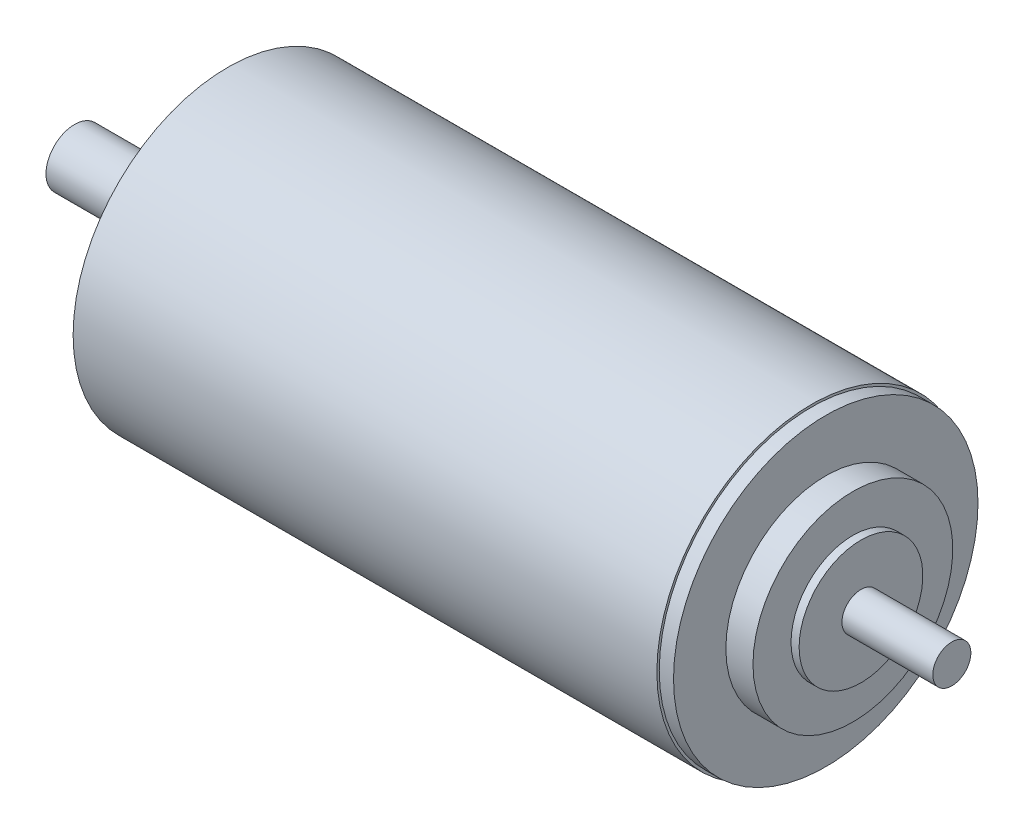
ISO-10303-21;
HEADER;
FILE_DESCRIPTION(('STEP AP214'),'2;1');
FILE_NAME('part.step','',(''),(''),'','','');
FILE_SCHEMA(('AUTOMOTIVE_DESIGN { 1 0 10303 214 1 1 1 1 }'));
ENDSEC;
DATA;
#1=APPLICATION_CONTEXT('core data for automotive mechanical design processes');
#2=APPLICATION_PROTOCOL_DEFINITION('international standard','automotive_design',2000,#1);
#3=PRODUCT_CONTEXT('',#1,'mechanical');
#4=PRODUCT('Part','Part','',(#3));
#5=PRODUCT_RELATED_PRODUCT_CATEGORY('part','',(#4));
#6=PRODUCT_DEFINITION_FORMATION('','',#4);
#7=PRODUCT_DEFINITION_CONTEXT('part definition',#1,'design');
#8=PRODUCT_DEFINITION('design','',#6,#7);
#9=PRODUCT_DEFINITION_SHAPE('','',#8);
#10=(LENGTH_UNIT() NAMED_UNIT(*) SI_UNIT(.MILLI.,.METRE.));
#11=(NAMED_UNIT(*) PLANE_ANGLE_UNIT() SI_UNIT($,.RADIAN.));
#12=(NAMED_UNIT(*) SI_UNIT($,.STERADIAN.) SOLID_ANGLE_UNIT());
#13=UNCERTAINTY_MEASURE_WITH_UNIT(LENGTH_MEASURE(1.E-05),#10,'distance_accuracy_value','');
#14=(GEOMETRIC_REPRESENTATION_CONTEXT(3) GLOBAL_UNCERTAINTY_ASSIGNED_CONTEXT((#13)) GLOBAL_UNIT_ASSIGNED_CONTEXT((#10,
#11,#12)) REPRESENTATION_CONTEXT('',''));
#15=CARTESIAN_POINT('',(0.,0.,0.));
#16=DIRECTION('',(0.,0.,1.));
#17=DIRECTION('',(1.,0.,0.));
#18=AXIS2_PLACEMENT_3D('',#15,#16,#17);
#19=CARTESIAN_POINT('',(0.,0.,0.));
#20=DIRECTION('',(1.,0.,0.));
#21=DIRECTION('',(0.,0.,-1.));
#22=AXIS2_PLACEMENT_3D('',#19,#20,#21);
#23=PLANE('',#22);
#24=CARTESIAN_POINT('',(0.,0.,0.));
#25=DIRECTION('',(-1.,0.,0.));
#26=DIRECTION('',(0.,0.,1.));
#27=AXIS2_PLACEMENT_3D('',#24,#25,#26);
#28=CIRCLE('',#27,6.);
#29=CARTESIAN_POINT('',(0.,0.,6.));
#30=VERTEX_POINT('',#29);
#31=EDGE_CURVE('E10',#30,#30,#28,.T.);
#32=ORIENTED_EDGE('',*,*,#31,.T.);
#33=EDGE_LOOP('',(#32));
#34=FACE_BOUND('',#33,.T.);
#35=ADVANCED_FACE('F30',(#34),#23,.F.);
#36=CARTESIAN_POINT('',(0.,0.,0.));
#37=DIRECTION('',(-1.,0.,0.));
#38=DIRECTION('',(0.,0.,1.));
#39=AXIS2_PLACEMENT_3D('',#36,#37,#38);
#40=CYLINDRICAL_SURFACE('',#39,6.);
#41=ORIENTED_EDGE('',*,*,#31,.F.);
#42=EDGE_LOOP('',(#41));
#43=FACE_BOUND('',#42,.T.);
#44=CARTESIAN_POINT('',(28.1,0.,0.));
#45=DIRECTION('',(-1.,0.,0.));
#46=DIRECTION('',(0.,0.,1.));
#47=AXIS2_PLACEMENT_3D('',#44,#45,#46);
#48=CIRCLE('',#47,6.);
#49=CARTESIAN_POINT('',(28.1,0.,6.));
#50=VERTEX_POINT('',#49);
#51=EDGE_CURVE('E36',#50,#50,#48,.T.);
#52=ORIENTED_EDGE('',*,*,#51,.T.);
#53=EDGE_LOOP('',(#52));
#54=FACE_BOUND('',#53,.T.);
#55=ADVANCED_FACE('F92',(#43,#54),#40,.T.);
#56=CARTESIAN_POINT('',(28.1,6.,0.));
#57=DIRECTION('',(1.,0.,0.));
#58=DIRECTION('',(0.,0.,-1.));
#59=AXIS2_PLACEMENT_3D('',#56,#57,#58);
#60=PLANE('',#59);
#61=ORIENTED_EDGE('',*,*,#51,.F.);
#62=EDGE_LOOP('',(#61));
#63=FACE_BOUND('',#62,.T.);
#64=CARTESIAN_POINT('',(28.1,0.,0.));
#65=DIRECTION('',(-1.,0.,0.));
#66=DIRECTION('',(0.,0.,1.));
#67=AXIS2_PLACEMENT_3D('',#64,#65,#66);
#68=CIRCLE('',#67,18.);
#69=CARTESIAN_POINT('',(28.1,0.,18.));
#70=VERTEX_POINT('',#69);
#71=EDGE_CURVE('E40',#70,#70,#68,.T.);
#72=ORIENTED_EDGE('',*,*,#71,.T.);
#73=EDGE_LOOP('',(#72));
#74=FACE_BOUND('',#73,.T.);
#75=ADVANCED_FACE('F96',(#63,#74),#60,.F.);
#76=CARTESIAN_POINT('',(0.,0.,0.));
#77=DIRECTION('',(-1.,0.,0.));
#78=DIRECTION('',(0.,0.,1.));
#79=AXIS2_PLACEMENT_3D('',#76,#77,#78);
#80=CYLINDRICAL_SURFACE('',#79,18.);
#81=ORIENTED_EDGE('',*,*,#71,.F.);
#82=EDGE_LOOP('',(#81));
#83=FACE_BOUND('',#82,.T.);
#84=CARTESIAN_POINT('',(32.2,0.,0.));
#85=DIRECTION('',(-1.,0.,0.));
#86=DIRECTION('',(0.,0.,1.));
#87=AXIS2_PLACEMENT_3D('',#84,#85,#86);
#88=CIRCLE('',#87,18.);
#89=CARTESIAN_POINT('',(32.2,0.,18.));
#90=VERTEX_POINT('',#89);
#91=EDGE_CURVE('E44',#90,#90,#88,.T.);
#92=ORIENTED_EDGE('',*,*,#91,.T.);
#93=EDGE_LOOP('',(#92));
#94=FACE_BOUND('',#93,.T.);
#95=ADVANCED_FACE('F101',(#83,#94),#80,.T.);
#96=CARTESIAN_POINT('',(32.2,18.,0.));
#97=DIRECTION('',(1.,0.,0.));
#98=DIRECTION('',(0.,0.,-1.));
#99=AXIS2_PLACEMENT_3D('',#96,#97,#98);
#100=PLANE('',#99);
#101=ORIENTED_EDGE('',*,*,#91,.F.);
#102=EDGE_LOOP('',(#101));
#103=FACE_BOUND('',#102,.T.);
#104=CARTESIAN_POINT('',(32.2,0.,0.));
#105=DIRECTION('',(-1.,0.,0.));
#106=DIRECTION('',(0.,0.,1.));
#107=AXIS2_PLACEMENT_3D('',#104,#105,#106);
#108=CIRCLE('',#107,32.5);
#109=CARTESIAN_POINT('',(32.2,0.,32.5));
#110=VERTEX_POINT('',#109);
#111=EDGE_CURVE('E49',#110,#110,#108,.T.);
#112=ORIENTED_EDGE('',*,*,#111,.T.);
#113=EDGE_LOOP('',(#112));
#114=FACE_BOUND('',#113,.T.);
#115=ADVANCED_FACE('F107',(#103,#114),#100,.F.);
#116=CARTESIAN_POINT('',(0.,0.,0.));
#117=DIRECTION('',(-1.,0.,0.));
#118=DIRECTION('',(0.,0.,1.));
#119=AXIS2_PLACEMENT_3D('',#116,#117,#118);
#120=CYLINDRICAL_SURFACE('',#119,32.5);
#121=ORIENTED_EDGE('',*,*,#111,.F.);
#122=EDGE_LOOP('',(#121));
#123=FACE_BOUND('',#122,.T.);
#124=CARTESIAN_POINT('',(154.9,0.,0.));
#125=DIRECTION('',(-1.,0.,0.));
#126=DIRECTION('',(0.,0.,1.));
#127=AXIS2_PLACEMENT_3D('',#124,#125,#126);
#128=CIRCLE('',#127,32.5);
#129=CARTESIAN_POINT('',(154.9,0.,32.5));
#130=VERTEX_POINT('',#129);
#131=EDGE_CURVE('E52',#130,#130,#128,.T.);
#132=ORIENTED_EDGE('',*,*,#131,.T.);
#133=EDGE_LOOP('',(#132));
#134=FACE_BOUND('',#133,.T.);
#135=ADVANCED_FACE('F111',(#123,#134),#120,.T.);
#136=CARTESIAN_POINT('',(154.9,32.5,0.));
#137=DIRECTION('',(-1.,0.,0.));
#138=DIRECTION('',(0.,0.,1.));
#139=AXIS2_PLACEMENT_3D('',#136,#137,#138);
#140=PLANE('',#139);
#141=ORIENTED_EDGE('',*,*,#131,.F.);
#142=EDGE_LOOP('',(#141));
#143=FACE_BOUND('',#142,.T.);
#144=CARTESIAN_POINT('',(154.9,0.,0.));
#145=DIRECTION('',(-1.,0.,0.));
#146=DIRECTION('',(0.,0.,1.));
#147=AXIS2_PLACEMENT_3D('',#144,#145,#146);
#148=CIRCLE('',#147,32.);
#149=CARTESIAN_POINT('',(154.9,0.,32.));
#150=VERTEX_POINT('',#149);
#151=EDGE_CURVE('E55',#150,#150,#148,.T.);
#152=ORIENTED_EDGE('',*,*,#151,.T.);
#153=EDGE_LOOP('',(#152));
#154=FACE_BOUND('',#153,.T.);
#155=ADVANCED_FACE('F115',(#143,#154),#140,.F.);
#156=CARTESIAN_POINT('',(0.,0.,0.));
#157=DIRECTION('',(-1.,0.,0.));
#158=DIRECTION('',(0.,0.,1.));
#159=AXIS2_PLACEMENT_3D('',#156,#157,#158);
#160=CYLINDRICAL_SURFACE('',#159,32.);
#161=ORIENTED_EDGE('',*,*,#151,.F.);
#162=EDGE_LOOP('',(#161));
#163=FACE_BOUND('',#162,.T.);
#164=CARTESIAN_POINT('',(157.9,0.,0.));
#165=DIRECTION('',(-1.,0.,0.));
#166=DIRECTION('',(0.,0.,1.));
#167=AXIS2_PLACEMENT_3D('',#164,#165,#166);
#168=CIRCLE('',#167,32.);
#169=CARTESIAN_POINT('',(157.9,0.,32.));
#170=VERTEX_POINT('',#169);
#171=EDGE_CURVE('E58',#170,#170,#168,.T.);
#172=ORIENTED_EDGE('',*,*,#171,.T.);
#173=EDGE_LOOP('',(#172));
#174=FACE_BOUND('',#173,.T.);
#175=ADVANCED_FACE('F119',(#163,#174),#160,.T.);
#176=CARTESIAN_POINT('',(157.9,32.,0.));
#177=DIRECTION('',(-1.,0.,0.));
#178=DIRECTION('',(0.,0.,1.));
#179=AXIS2_PLACEMENT_3D('',#176,#177,#178);
#180=PLANE('',#179);
#181=ORIENTED_EDGE('',*,*,#171,.F.);
#182=EDGE_LOOP('',(#181));
#183=FACE_BOUND('',#182,.T.);
#184=CARTESIAN_POINT('',(157.9,0.,0.));
#185=DIRECTION('',(-1.,0.,0.));
#186=DIRECTION('',(0.,0.,1.));
#187=AXIS2_PLACEMENT_3D('',#184,#185,#186);
#188=CIRCLE('',#187,21.);
#189=CARTESIAN_POINT('',(157.9,0.,21.));
#190=VERTEX_POINT('',#189);
#191=EDGE_CURVE('E61',#190,#190,#188,.T.);
#192=ORIENTED_EDGE('',*,*,#191,.T.);
#193=EDGE_LOOP('',(#192));
#194=FACE_BOUND('',#193,.T.);
#195=ADVANCED_FACE('F123',(#183,#194),#180,.F.);
#196=CARTESIAN_POINT('',(0.,0.,0.));
#197=DIRECTION('',(-1.,0.,0.));
#198=DIRECTION('',(0.,0.,1.));
#199=AXIS2_PLACEMENT_3D('',#196,#197,#198);
#200=CYLINDRICAL_SURFACE('',#199,21.);
#201=ORIENTED_EDGE('',*,*,#191,.F.);
#202=EDGE_LOOP('',(#201));
#203=FACE_BOUND('',#202,.T.);
#204=CARTESIAN_POINT('',(163.6,0.,0.));
#205=DIRECTION('',(-1.,0.,0.));
#206=DIRECTION('',(0.,0.,1.));
#207=AXIS2_PLACEMENT_3D('',#204,#205,#206);
#208=CIRCLE('',#207,21.);
#209=CARTESIAN_POINT('',(163.6,0.,21.));
#210=VERTEX_POINT('',#209);
#211=EDGE_CURVE('E64',#210,#210,#208,.T.);
#212=ORIENTED_EDGE('',*,*,#211,.T.);
#213=EDGE_LOOP('',(#212));
#214=FACE_BOUND('',#213,.T.);
#215=ADVANCED_FACE('F127',(#203,#214),#200,.T.);
#216=CARTESIAN_POINT('',(163.6,21.,0.));
#217=DIRECTION('',(-1.,0.,0.));
#218=DIRECTION('',(0.,0.,1.));
#219=AXIS2_PLACEMENT_3D('',#216,#217,#218);
#220=PLANE('',#219);
#221=ORIENTED_EDGE('',*,*,#211,.F.);
#222=EDGE_LOOP('',(#221));
#223=FACE_BOUND('',#222,.T.);
#224=CARTESIAN_POINT('',(163.6,0.,0.));
#225=DIRECTION('',(-1.,0.,0.));
#226=DIRECTION('',(0.,0.,1.));
#227=AXIS2_PLACEMENT_3D('',#224,#225,#226);
#228=CIRCLE('',#227,13.);
#229=CARTESIAN_POINT('',(163.6,0.,13.));
#230=VERTEX_POINT('',#229);
#231=EDGE_CURVE('E67',#230,#230,#228,.T.);
#232=ORIENTED_EDGE('',*,*,#231,.T.);
#233=EDGE_LOOP('',(#232));
#234=FACE_BOUND('',#233,.T.);
#235=ADVANCED_FACE('F131',(#223,#234),#220,.F.);
#236=CARTESIAN_POINT('',(0.,0.,0.));
#237=DIRECTION('',(-1.,0.,0.));
#238=DIRECTION('',(0.,0.,1.));
#239=AXIS2_PLACEMENT_3D('',#236,#237,#238);
#240=CYLINDRICAL_SURFACE('',#239,13.);
#241=ORIENTED_EDGE('',*,*,#231,.F.);
#242=EDGE_LOOP('',(#241));
#243=FACE_BOUND('',#242,.T.);
#244=CARTESIAN_POINT('',(165.3,0.,0.));
#245=DIRECTION('',(-1.,0.,0.));
#246=DIRECTION('',(0.,0.,1.));
#247=AXIS2_PLACEMENT_3D('',#244,#245,#246);
#248=CIRCLE('',#247,13.);
#249=CARTESIAN_POINT('',(165.3,0.,13.));
#250=VERTEX_POINT('',#249);
#251=EDGE_CURVE('E70',#250,#250,#248,.T.);
#252=ORIENTED_EDGE('',*,*,#251,.T.);
#253=EDGE_LOOP('',(#252));
#254=FACE_BOUND('',#253,.T.);
#255=ADVANCED_FACE('F135',(#243,#254),#240,.T.);
#256=CARTESIAN_POINT('',(165.3,13.,0.));
#257=DIRECTION('',(-1.,0.,0.));
#258=DIRECTION('',(0.,0.,1.));
#259=AXIS2_PLACEMENT_3D('',#256,#257,#258);
#260=PLANE('',#259);
#261=ORIENTED_EDGE('',*,*,#251,.F.);
#262=EDGE_LOOP('',(#261));
#263=FACE_BOUND('',#262,.T.);
#264=CARTESIAN_POINT('',(165.3,0.,0.));
#265=DIRECTION('',(-1.,0.,0.));
#266=DIRECTION('',(0.,0.,1.));
#267=AXIS2_PLACEMENT_3D('',#264,#265,#266);
#268=CIRCLE('',#267,4.);
#269=CARTESIAN_POINT('',(165.3,0.,4.));
#270=VERTEX_POINT('',#269);
#271=EDGE_CURVE('E73',#270,#270,#268,.T.);
#272=ORIENTED_EDGE('',*,*,#271,.T.);
#273=EDGE_LOOP('',(#272));
#274=FACE_BOUND('',#273,.T.);
#275=ADVANCED_FACE('F88',(#263,#274),#260,.F.);
#276=CARTESIAN_POINT('',(0.,0.,0.));
#277=DIRECTION('',(-1.,0.,0.));
#278=DIRECTION('',(0.,0.,1.));
#279=AXIS2_PLACEMENT_3D('',#276,#277,#278);
#280=CYLINDRICAL_SURFACE('',#279,4.);
#281=ORIENTED_EDGE('',*,*,#271,.F.);
#282=EDGE_LOOP('',(#281));
#283=FACE_BOUND('',#282,.T.);
#284=CARTESIAN_POINT('',(184.4,0.,0.));
#285=DIRECTION('',(-1.,0.,0.));
#286=DIRECTION('',(0.,0.,1.));
#287=AXIS2_PLACEMENT_3D('',#284,#285,#286);
#288=CIRCLE('',#287,4.);
#289=CARTESIAN_POINT('',(184.4,0.,4.));
#290=VERTEX_POINT('',#289);
#291=EDGE_CURVE('E76',#290,#290,#288,.T.);
#292=ORIENTED_EDGE('',*,*,#291,.T.);
#293=EDGE_LOOP('',(#292));
#294=FACE_BOUND('',#293,.T.);
#295=ADVANCED_FACE('F80',(#283,#294),#280,.T.);
#296=CARTESIAN_POINT('',(184.4,4.,0.));
#297=DIRECTION('',(-1.,0.,0.));
#298=DIRECTION('',(0.,0.,1.));
#299=AXIS2_PLACEMENT_3D('',#296,#297,#298);
#300=PLANE('',#299);
#301=ORIENTED_EDGE('',*,*,#291,.F.);
#302=EDGE_LOOP('',(#301));
#303=FACE_BOUND('',#302,.T.);
#304=ADVANCED_FACE('F82',(#303),#300,.F.);
#305=CLOSED_SHELL('',(#35,#55,#75,#95,#115,#135,#155,#175,#195,#215,#235,#255,#275,#295,#304));
#306=MANIFOLD_SOLID_BREP('B2',#305);
#307=ADVANCED_BREP_SHAPE_REPRESENTATION('',(#18,#306),#14);
#308=SHAPE_DEFINITION_REPRESENTATION(#9,#307);
ENDSEC;
END-ISO-10303-21;
